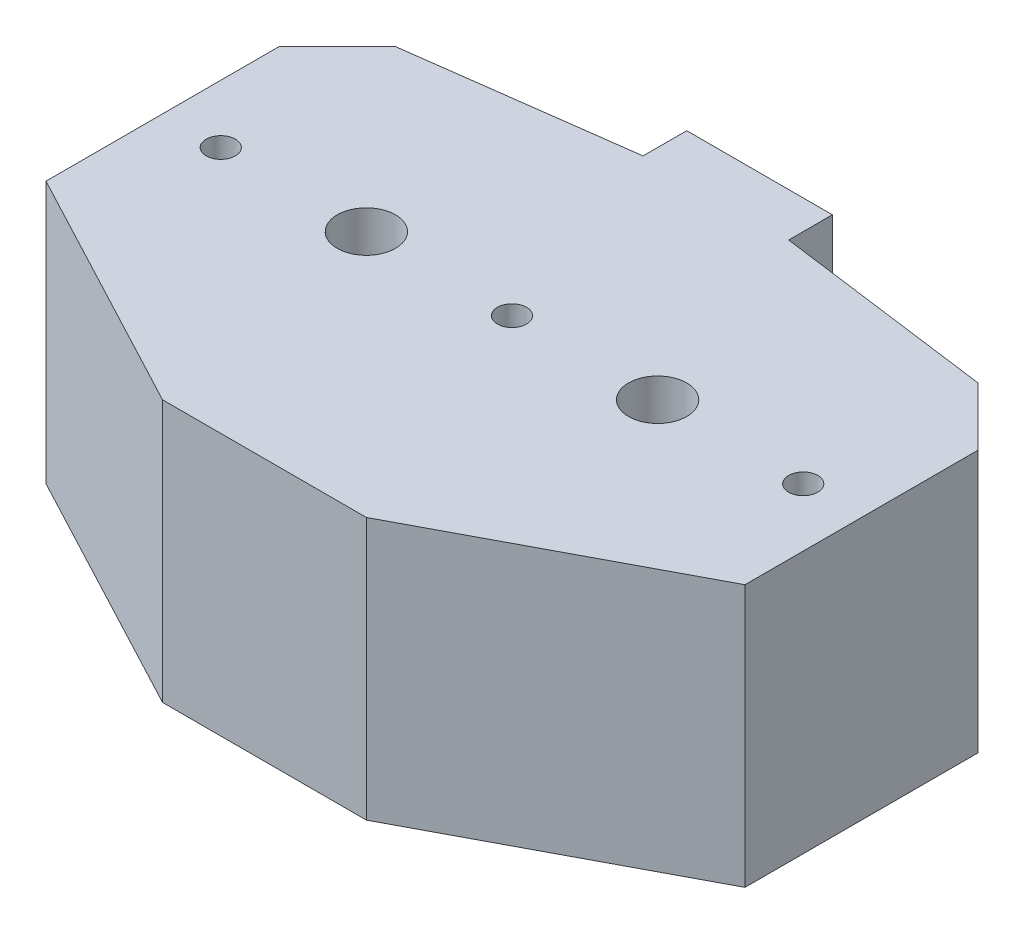
ISO-10303-21;
HEADER;
FILE_DESCRIPTION(('STEP AP214'),'2;1');
FILE_NAME('part.step','',(''),(''),'','','');
FILE_SCHEMA(('AUTOMOTIVE_DESIGN { 1 0 10303 214 1 1 1 1 }'));
ENDSEC;
DATA;
#1=APPLICATION_CONTEXT('core data for automotive mechanical design processes');
#2=APPLICATION_PROTOCOL_DEFINITION('international standard','automotive_design',2000,#1);
#3=PRODUCT_CONTEXT('',#1,'mechanical');
#4=PRODUCT('Part','Part','',(#3));
#5=PRODUCT_RELATED_PRODUCT_CATEGORY('part','',(#4));
#6=PRODUCT_DEFINITION_FORMATION('','',#4);
#7=PRODUCT_DEFINITION_CONTEXT('part definition',#1,'design');
#8=PRODUCT_DEFINITION('design','',#6,#7);
#9=PRODUCT_DEFINITION_SHAPE('','',#8);
#10=(LENGTH_UNIT() NAMED_UNIT(*) SI_UNIT(.MILLI.,.METRE.));
#11=(NAMED_UNIT(*) PLANE_ANGLE_UNIT() SI_UNIT($,.RADIAN.));
#12=(NAMED_UNIT(*) SI_UNIT($,.STERADIAN.) SOLID_ANGLE_UNIT());
#13=UNCERTAINTY_MEASURE_WITH_UNIT(LENGTH_MEASURE(1.E-05),#10,'distance_accuracy_value','');
#14=(GEOMETRIC_REPRESENTATION_CONTEXT(3) GLOBAL_UNCERTAINTY_ASSIGNED_CONTEXT((#13)) GLOBAL_UNIT_ASSIGNED_CONTEXT((#10,
#11,#12)) REPRESENTATION_CONTEXT('',''));
#15=CARTESIAN_POINT('',(0.,0.,0.));
#16=DIRECTION('',(0.,0.,1.));
#17=DIRECTION('',(1.,0.,0.));
#18=AXIS2_PLACEMENT_3D('',#15,#16,#17);
#19=CARTESIAN_POINT('',(0.,18.,0.));
#20=DIRECTION('',(0.,-1.,0.));
#21=DIRECTION('',(0.,0.,-1.));
#22=AXIS2_PLACEMENT_3D('',#19,#20,#21);
#23=PLANE('',#22);
#24=DIRECTION('',(-0.991227900682635,0.,0.132163720091018));
#25=VECTOR('',#24,1.);
#26=CARTESIAN_POINT('',(-20.,18.,-12.));
#27=LINE('',#26,#25);
#28=CARTESIAN_POINT('',(-5.,18.,-14.));
#29=VERTEX_POINT('',#28);
#30=CARTESIAN_POINT('',(-20.,18.,-12.));
#31=VERTEX_POINT('',#30);
#32=EDGE_CURVE('E178',#29,#31,#27,.T.);
#33=ORIENTED_EDGE('',*,*,#32,.T.);
#34=DIRECTION('',(-0.707106781186548,0.,0.707106781186548));
#35=VECTOR('',#34,1.);
#36=CARTESIAN_POINT('',(-24.,18.,-8.));
#37=LINE('',#36,#35);
#38=CARTESIAN_POINT('',(-24.,18.,-8.));
#39=VERTEX_POINT('',#38);
#40=EDGE_CURVE('E106',#31,#39,#37,.T.);
#41=ORIENTED_EDGE('',*,*,#40,.T.);
#42=DIRECTION('',(0.,0.,1.));
#43=VECTOR('',#42,1.);
#44=CARTESIAN_POINT('',(-24.,18.,8.));
#45=LINE('',#44,#43);
#46=CARTESIAN_POINT('',(-24.,18.,8.));
#47=VERTEX_POINT('',#46);
#48=EDGE_CURVE('E205',#39,#47,#45,.T.);
#49=ORIENTED_EDGE('',*,*,#48,.T.);
#50=DIRECTION('',(0.883787916347062,0.,0.467887720419033));
#51=VECTOR('',#50,1.);
#52=CARTESIAN_POINT('',(-7.,18.,17.));
#53=LINE('',#52,#51);
#54=CARTESIAN_POINT('',(-7.,18.,17.));
#55=VERTEX_POINT('',#54);
#56=EDGE_CURVE('E224',#47,#55,#53,.T.);
#57=ORIENTED_EDGE('',*,*,#56,.T.);
#58=DIRECTION('',(1.,0.,0.));
#59=VECTOR('',#58,1.);
#60=CARTESIAN_POINT('',(7.,18.,17.));
#61=LINE('',#60,#59);
#62=CARTESIAN_POINT('',(7.,18.,17.));
#63=VERTEX_POINT('',#62);
#64=EDGE_CURVE('E221',#55,#63,#61,.T.);
#65=ORIENTED_EDGE('',*,*,#64,.T.);
#66=DIRECTION('',(0.883787916347062,0.,-0.467887720419033));
#67=VECTOR('',#66,1.);
#68=CARTESIAN_POINT('',(24.,18.,8.));
#69=LINE('',#68,#67);
#70=CARTESIAN_POINT('',(24.,18.,8.));
#71=VERTEX_POINT('',#70);
#72=EDGE_CURVE('E223',#63,#71,#69,.T.);
#73=ORIENTED_EDGE('',*,*,#72,.T.);
#74=DIRECTION('',(0.,0.,-1.));
#75=VECTOR('',#74,1.);
#76=CARTESIAN_POINT('',(24.,18.,-8.));
#77=LINE('',#76,#75);
#78=CARTESIAN_POINT('',(24.,18.,-8.));
#79=VERTEX_POINT('',#78);
#80=EDGE_CURVE('E226',#71,#79,#77,.T.);
#81=ORIENTED_EDGE('',*,*,#80,.T.);
#82=DIRECTION('',(-0.707106781186548,0.,-0.707106781186548));
#83=VECTOR('',#82,1.);
#84=CARTESIAN_POINT('',(20.,18.,-12.));
#85=LINE('',#84,#83);
#86=CARTESIAN_POINT('',(20.,18.,-12.));
#87=VERTEX_POINT('',#86);
#88=EDGE_CURVE('E232',#79,#87,#85,.T.);
#89=ORIENTED_EDGE('',*,*,#88,.T.);
#90=DIRECTION('',(-0.991227900682635,0.,-0.132163720091018));
#91=VECTOR('',#90,1.);
#92=CARTESIAN_POINT('',(5.,18.,-14.));
#93=LINE('',#92,#91);
#94=CARTESIAN_POINT('',(5.,18.,-14.));
#95=VERTEX_POINT('',#94);
#96=EDGE_CURVE('E137',#87,#95,#93,.T.);
#97=ORIENTED_EDGE('',*,*,#96,.T.);
#98=DIRECTION('',(0.,0.,-1.));
#99=VECTOR('',#98,1.);
#100=CARTESIAN_POINT('',(5.,18.,-17.));
#101=LINE('',#100,#99);
#102=CARTESIAN_POINT('',(5.,18.,-17.));
#103=VERTEX_POINT('',#102);
#104=EDGE_CURVE('E131',#95,#103,#101,.T.);
#105=ORIENTED_EDGE('',*,*,#104,.T.);
#106=DIRECTION('',(-1.,0.,0.));
#107=VECTOR('',#106,1.);
#108=CARTESIAN_POINT('',(-5.,18.,-17.));
#109=LINE('',#108,#107);
#110=CARTESIAN_POINT('',(-5.,18.,-17.));
#111=VERTEX_POINT('',#110);
#112=EDGE_CURVE('E135',#103,#111,#109,.T.);
#113=ORIENTED_EDGE('',*,*,#112,.T.);
#114=DIRECTION('',(0.,0.,1.));
#115=VECTOR('',#114,1.);
#116=CARTESIAN_POINT('',(-5.,18.,-17.));
#117=LINE('',#116,#115);
#118=EDGE_CURVE('E51',#111,#29,#117,.T.);
#119=ORIENTED_EDGE('',*,*,#118,.T.);
#120=EDGE_LOOP('',(#33,#41,#49,#57,#65,#73,#81,#89,#97,#105,#113,#119));
#121=FACE_BOUND('',#120,.T.);
#122=CARTESIAN_POINT('',(20.,18.,0.));
#123=DIRECTION('',(0.,1.,0.));
#124=DIRECTION('',(0.,0.,1.));
#125=AXIS2_PLACEMENT_3D('',#122,#123,#124);
#126=CIRCLE('',#125,1.);
#127=CARTESIAN_POINT('',(20.,18.,1.));
#128=VERTEX_POINT('',#127);
#129=EDGE_CURVE('E159',#128,#128,#126,.T.);
#130=ORIENTED_EDGE('',*,*,#129,.F.);
#131=EDGE_LOOP('',(#130));
#132=FACE_BOUND('',#131,.T.);
#133=CARTESIAN_POINT('',(-20.,18.,1.39659253553725E-13));
#134=DIRECTION('',(0.,1.,0.));
#135=DIRECTION('',(0.,0.,1.));
#136=AXIS2_PLACEMENT_3D('',#133,#134,#135);
#137=CIRCLE('',#136,1.);
#138=CARTESIAN_POINT('',(-20.,18.,1.00000000000014));
#139=VERTEX_POINT('',#138);
#140=EDGE_CURVE('E306',#139,#139,#137,.T.);
#141=ORIENTED_EDGE('',*,*,#140,.F.);
#142=EDGE_LOOP('',(#141));
#143=FACE_BOUND('',#142,.T.);
#144=CARTESIAN_POINT('',(-10.,18.,0.));
#145=DIRECTION('',(0.,1.,0.));
#146=DIRECTION('',(0.,0.,1.));
#147=AXIS2_PLACEMENT_3D('',#144,#145,#146);
#148=CIRCLE('',#147,2.);
#149=CARTESIAN_POINT('',(-10.,18.,2.));
#150=VERTEX_POINT('',#149);
#151=EDGE_CURVE('E300',#150,#150,#148,.T.);
#152=ORIENTED_EDGE('',*,*,#151,.F.);
#153=EDGE_LOOP('',(#152));
#154=FACE_BOUND('',#153,.T.);
#155=CARTESIAN_POINT('',(0.,18.,0.));
#156=DIRECTION('',(0.,1.,0.));
#157=DIRECTION('',(0.,0.,1.));
#158=AXIS2_PLACEMENT_3D('',#155,#156,#157);
#159=CIRCLE('',#158,1.);
#160=CARTESIAN_POINT('',(0.,18.,1.));
#161=VERTEX_POINT('',#160);
#162=EDGE_CURVE('E294',#161,#161,#159,.T.);
#163=ORIENTED_EDGE('',*,*,#162,.F.);
#164=EDGE_LOOP('',(#163));
#165=FACE_BOUND('',#164,.T.);
#166=CARTESIAN_POINT('',(10.,18.,0.));
#167=DIRECTION('',(0.,1.,0.));
#168=DIRECTION('',(0.,0.,1.));
#169=AXIS2_PLACEMENT_3D('',#166,#167,#168);
#170=CIRCLE('',#169,2.);
#171=CARTESIAN_POINT('',(10.,18.,2.));
#172=VERTEX_POINT('',#171);
#173=EDGE_CURVE('E285',#172,#172,#170,.T.);
#174=ORIENTED_EDGE('',*,*,#173,.F.);
#175=EDGE_LOOP('',(#174));
#176=FACE_BOUND('',#175,.T.);
#177=ADVANCED_FACE('F34',(#121,#132,#143,#154,#165,#176),#23,.F.);
#178=CARTESIAN_POINT('',(0.,0.,0.));
#179=DIRECTION('',(0.,-1.,0.));
#180=DIRECTION('',(0.,0.,-1.));
#181=AXIS2_PLACEMENT_3D('',#178,#179,#180);
#182=PLANE('',#181);
#183=CARTESIAN_POINT('',(0.,0.,0.));
#184=DIRECTION('',(0.,1.,0.));
#185=DIRECTION('',(0.,0.,1.));
#186=AXIS2_PLACEMENT_3D('',#183,#184,#185);
#187=CIRCLE('',#186,1.);
#188=CARTESIAN_POINT('',(0.,0.,1.));
#189=VERTEX_POINT('',#188);
#190=EDGE_CURVE('E291',#189,#189,#187,.T.);
#191=ORIENTED_EDGE('',*,*,#190,.T.);
#192=EDGE_LOOP('',(#191));
#193=FACE_BOUND('',#192,.T.);
#194=CARTESIAN_POINT('',(-20.,0.,1.39659253553725E-13));
#195=DIRECTION('',(0.,1.,0.));
#196=DIRECTION('',(0.,0.,1.));
#197=AXIS2_PLACEMENT_3D('',#194,#195,#196);
#198=CIRCLE('',#197,1.);
#199=CARTESIAN_POINT('',(-20.,0.,1.00000000000014));
#200=VERTEX_POINT('',#199);
#201=EDGE_CURVE('E303',#200,#200,#198,.T.);
#202=ORIENTED_EDGE('',*,*,#201,.T.);
#203=EDGE_LOOP('',(#202));
#204=FACE_BOUND('',#203,.T.);
#205=DIRECTION('',(-0.991227900682635,0.,0.132163720091018));
#206=VECTOR('',#205,1.);
#207=CARTESIAN_POINT('',(-20.,0.,-12.));
#208=LINE('',#207,#206);
#209=CARTESIAN_POINT('',(-5.,0.,-14.));
#210=VERTEX_POINT('',#209);
#211=CARTESIAN_POINT('',(-20.,0.,-12.));
#212=VERTEX_POINT('',#211);
#213=EDGE_CURVE('E155',#210,#212,#208,.T.);
#214=ORIENTED_EDGE('',*,*,#213,.F.);
#215=DIRECTION('',(0.,0.,1.));
#216=VECTOR('',#215,1.);
#217=CARTESIAN_POINT('',(-5.,0.,-17.));
#218=LINE('',#217,#216);
#219=CARTESIAN_POINT('',(-5.,0.,-17.));
#220=VERTEX_POINT('',#219);
#221=EDGE_CURVE('E98',#220,#210,#218,.T.);
#222=ORIENTED_EDGE('',*,*,#221,.F.);
#223=DIRECTION('',(-1.,0.,0.));
#224=VECTOR('',#223,1.);
#225=CARTESIAN_POINT('',(-5.,0.,-17.));
#226=LINE('',#225,#224);
#227=CARTESIAN_POINT('',(5.,0.,-17.));
#228=VERTEX_POINT('',#227);
#229=EDGE_CURVE('E92',#228,#220,#226,.T.);
#230=ORIENTED_EDGE('',*,*,#229,.F.);
#231=DIRECTION('',(0.,0.,-1.));
#232=VECTOR('',#231,1.);
#233=CARTESIAN_POINT('',(5.,0.,-17.));
#234=LINE('',#233,#232);
#235=CARTESIAN_POINT('',(5.,0.,-14.));
#236=VERTEX_POINT('',#235);
#237=EDGE_CURVE('E145',#236,#228,#234,.T.);
#238=ORIENTED_EDGE('',*,*,#237,.F.);
#239=DIRECTION('',(-0.991227900682635,0.,-0.132163720091018));
#240=VECTOR('',#239,1.);
#241=CARTESIAN_POINT('',(5.,0.,-14.));
#242=LINE('',#241,#240);
#243=CARTESIAN_POINT('',(20.,0.,-12.));
#244=VERTEX_POINT('',#243);
#245=EDGE_CURVE('E173',#244,#236,#242,.T.);
#246=ORIENTED_EDGE('',*,*,#245,.F.);
#247=DIRECTION('',(-0.707106781186548,0.,-0.707106781186548));
#248=VECTOR('',#247,1.);
#249=CARTESIAN_POINT('',(20.,0.,-12.));
#250=LINE('',#249,#248);
#251=CARTESIAN_POINT('',(24.,0.,-8.));
#252=VERTEX_POINT('',#251);
#253=EDGE_CURVE('E171',#252,#244,#250,.T.);
#254=ORIENTED_EDGE('',*,*,#253,.F.);
#255=DIRECTION('',(0.,0.,-1.));
#256=VECTOR('',#255,1.);
#257=CARTESIAN_POINT('',(24.,0.,-8.));
#258=LINE('',#257,#256);
#259=CARTESIAN_POINT('',(24.,0.,8.));
#260=VERTEX_POINT('',#259);
#261=EDGE_CURVE('E169',#260,#252,#258,.T.);
#262=ORIENTED_EDGE('',*,*,#261,.F.);
#263=DIRECTION('',(0.883787916347062,0.,-0.467887720419033));
#264=VECTOR('',#263,1.);
#265=CARTESIAN_POINT('',(24.,0.,8.));
#266=LINE('',#265,#264);
#267=CARTESIAN_POINT('',(7.,0.,17.));
#268=VERTEX_POINT('',#267);
#269=EDGE_CURVE('E167',#268,#260,#266,.T.);
#270=ORIENTED_EDGE('',*,*,#269,.F.);
#271=DIRECTION('',(1.,0.,0.));
#272=VECTOR('',#271,1.);
#273=CARTESIAN_POINT('',(7.,0.,17.));
#274=LINE('',#273,#272);
#275=CARTESIAN_POINT('',(-7.,0.,17.));
#276=VERTEX_POINT('',#275);
#277=EDGE_CURVE('E165',#276,#268,#274,.T.);
#278=ORIENTED_EDGE('',*,*,#277,.F.);
#279=DIRECTION('',(0.883787916347062,0.,0.467887720419033));
#280=VECTOR('',#279,1.);
#281=CARTESIAN_POINT('',(-7.,0.,17.));
#282=LINE('',#281,#280);
#283=CARTESIAN_POINT('',(-24.,0.,8.));
#284=VERTEX_POINT('',#283);
#285=EDGE_CURVE('E163',#284,#276,#282,.T.);
#286=ORIENTED_EDGE('',*,*,#285,.F.);
#287=DIRECTION('',(0.,0.,1.));
#288=VECTOR('',#287,1.);
#289=CARTESIAN_POINT('',(-24.,0.,8.));
#290=LINE('',#289,#288);
#291=CARTESIAN_POINT('',(-24.,0.,-8.));
#292=VERTEX_POINT('',#291);
#293=EDGE_CURVE('E161',#292,#284,#290,.T.);
#294=ORIENTED_EDGE('',*,*,#293,.F.);
#295=DIRECTION('',(-0.707106781186548,0.,0.707106781186548));
#296=VECTOR('',#295,1.);
#297=CARTESIAN_POINT('',(-24.,0.,-8.));
#298=LINE('',#297,#296);
#299=EDGE_CURVE('E158',#212,#292,#298,.T.);
#300=ORIENTED_EDGE('',*,*,#299,.F.);
#301=EDGE_LOOP('',(#214,#222,#230,#238,#246,#254,#262,#270,#278,#286,#294,#300));
#302=FACE_BOUND('',#301,.T.);
#303=CARTESIAN_POINT('',(20.,0.,0.));
#304=DIRECTION('',(0.,1.,0.));
#305=DIRECTION('',(0.,0.,1.));
#306=AXIS2_PLACEMENT_3D('',#303,#304,#305);
#307=CIRCLE('',#306,1.);
#308=CARTESIAN_POINT('',(20.,0.,1.));
#309=VERTEX_POINT('',#308);
#310=EDGE_CURVE('E309',#309,#309,#307,.T.);
#311=ORIENTED_EDGE('',*,*,#310,.T.);
#312=EDGE_LOOP('',(#311));
#313=FACE_BOUND('',#312,.T.);
#314=CARTESIAN_POINT('',(-10.,0.,0.));
#315=DIRECTION('',(0.,1.,0.));
#316=DIRECTION('',(0.,0.,1.));
#317=AXIS2_PLACEMENT_3D('',#314,#315,#316);
#318=CIRCLE('',#317,2.);
#319=CARTESIAN_POINT('',(-10.,0.,2.));
#320=VERTEX_POINT('',#319);
#321=EDGE_CURVE('E297',#320,#320,#318,.T.);
#322=ORIENTED_EDGE('',*,*,#321,.T.);
#323=EDGE_LOOP('',(#322));
#324=FACE_BOUND('',#323,.T.);
#325=CARTESIAN_POINT('',(10.,0.,0.));
#326=DIRECTION('',(0.,1.,0.));
#327=DIRECTION('',(0.,0.,1.));
#328=AXIS2_PLACEMENT_3D('',#325,#326,#327);
#329=CIRCLE('',#328,2.);
#330=CARTESIAN_POINT('',(10.,0.,2.));
#331=VERTEX_POINT('',#330);
#332=EDGE_CURVE('E288',#331,#331,#329,.T.);
#333=ORIENTED_EDGE('',*,*,#332,.T.);
#334=EDGE_LOOP('',(#333));
#335=FACE_BOUND('',#334,.T.);
#336=ADVANCED_FACE('F209',(#193,#204,#302,#313,#324,#335),#182,.T.);
#337=CARTESIAN_POINT('',(-20.,18.,-12.));
#338=DIRECTION('',(0.132163720091018,0.,0.991227900682635));
#339=DIRECTION('',(0.991227900682635,0.,-0.132163720091018));
#340=AXIS2_PLACEMENT_3D('',#337,#338,#339);
#341=PLANE('',#340);
#342=ORIENTED_EDGE('',*,*,#213,.T.);
#343=DIRECTION('',(0.,-1.,0.));
#344=VECTOR('',#343,1.);
#345=CARTESIAN_POINT('',(-20.,18.,-12.));
#346=LINE('',#345,#344);
#347=EDGE_CURVE('E11',#31,#212,#346,.T.);
#348=ORIENTED_EDGE('',*,*,#347,.F.);
#349=ORIENTED_EDGE('',*,*,#32,.F.);
#350=DIRECTION('',(0.,-1.,0.));
#351=VECTOR('',#350,1.);
#352=CARTESIAN_POINT('',(-5.,18.,-14.));
#353=LINE('',#352,#351);
#354=EDGE_CURVE('E151',#29,#210,#353,.T.);
#355=ORIENTED_EDGE('',*,*,#354,.T.);
#356=EDGE_LOOP('',(#342,#348,#349,#355));
#357=FACE_BOUND('',#356,.T.);
#358=ADVANCED_FACE('F36',(#357),#341,.F.);
#359=CARTESIAN_POINT('',(-24.,18.,-8.));
#360=DIRECTION('',(0.707106781186547,0.,0.707106781186547));
#361=DIRECTION('',(0.707106781186548,0.,-0.707106781186548));
#362=AXIS2_PLACEMENT_3D('',#359,#360,#361);
#363=PLANE('',#362);
#364=ORIENTED_EDGE('',*,*,#299,.T.);
#365=DIRECTION('',(0.,-1.,0.));
#366=VECTOR('',#365,1.);
#367=CARTESIAN_POINT('',(-24.,18.,-8.));
#368=LINE('',#367,#366);
#369=EDGE_CURVE('E43',#39,#292,#368,.T.);
#370=ORIENTED_EDGE('',*,*,#369,.F.);
#371=ORIENTED_EDGE('',*,*,#40,.F.);
#372=ORIENTED_EDGE('',*,*,#347,.T.);
#373=EDGE_LOOP('',(#364,#370,#371,#372));
#374=FACE_BOUND('',#373,.T.);
#375=ADVANCED_FACE('F430',(#374),#363,.F.);
#376=CARTESIAN_POINT('',(-24.,18.,8.));
#377=DIRECTION('',(1.,0.,0.));
#378=DIRECTION('',(0.,0.,-1.));
#379=AXIS2_PLACEMENT_3D('',#376,#377,#378);
#380=PLANE('',#379);
#381=ORIENTED_EDGE('',*,*,#293,.T.);
#382=DIRECTION('',(0.,-1.,0.));
#383=VECTOR('',#382,1.);
#384=CARTESIAN_POINT('',(-24.,18.,8.));
#385=LINE('',#384,#383);
#386=EDGE_CURVE('E197',#47,#284,#385,.T.);
#387=ORIENTED_EDGE('',*,*,#386,.F.);
#388=ORIENTED_EDGE('',*,*,#48,.F.);
#389=ORIENTED_EDGE('',*,*,#369,.T.);
#390=EDGE_LOOP('',(#381,#387,#388,#389));
#391=FACE_BOUND('',#390,.T.);
#392=ADVANCED_FACE('F203',(#391),#380,.F.);
#393=CARTESIAN_POINT('',(-7.,18.,17.));
#394=DIRECTION('',(0.467887720419033,0.,-0.883787916347062));
#395=DIRECTION('',(-0.883787916347062,0.,-0.467887720419033));
#396=AXIS2_PLACEMENT_3D('',#393,#394,#395);
#397=PLANE('',#396);
#398=ORIENTED_EDGE('',*,*,#285,.T.);
#399=DIRECTION('',(0.,-1.,0.));
#400=VECTOR('',#399,1.);
#401=CARTESIAN_POINT('',(-7.,18.,17.));
#402=LINE('',#401,#400);
#403=EDGE_CURVE('E194',#55,#276,#402,.T.);
#404=ORIENTED_EDGE('',*,*,#403,.F.);
#405=ORIENTED_EDGE('',*,*,#56,.F.);
#406=ORIENTED_EDGE('',*,*,#386,.T.);
#407=EDGE_LOOP('',(#398,#404,#405,#406));
#408=FACE_BOUND('',#407,.T.);
#409=ADVANCED_FACE('F215',(#408),#397,.F.);
#410=CARTESIAN_POINT('',(7.,18.,17.));
#411=DIRECTION('',(0.,0.,-1.));
#412=DIRECTION('',(-1.,0.,0.));
#413=AXIS2_PLACEMENT_3D('',#410,#411,#412);
#414=PLANE('',#413);
#415=ORIENTED_EDGE('',*,*,#277,.T.);
#416=DIRECTION('',(0.,-1.,0.));
#417=VECTOR('',#416,1.);
#418=CARTESIAN_POINT('',(7.,18.,17.));
#419=LINE('',#418,#417);
#420=EDGE_CURVE('E191',#63,#268,#419,.T.);
#421=ORIENTED_EDGE('',*,*,#420,.F.);
#422=ORIENTED_EDGE('',*,*,#64,.F.);
#423=ORIENTED_EDGE('',*,*,#403,.T.);
#424=EDGE_LOOP('',(#415,#421,#422,#423));
#425=FACE_BOUND('',#424,.T.);
#426=ADVANCED_FACE('F219',(#425),#414,.F.);
#427=CARTESIAN_POINT('',(24.,18.,8.));
#428=DIRECTION('',(-0.467887720419033,0.,-0.883787916347062));
#429=DIRECTION('',(-0.883787916347062,0.,0.467887720419033));
#430=AXIS2_PLACEMENT_3D('',#427,#428,#429);
#431=PLANE('',#430);
#432=ORIENTED_EDGE('',*,*,#269,.T.);
#433=DIRECTION('',(0.,-1.,0.));
#434=VECTOR('',#433,1.);
#435=CARTESIAN_POINT('',(24.,18.,8.));
#436=LINE('',#435,#434);
#437=EDGE_CURVE('E188',#71,#260,#436,.T.);
#438=ORIENTED_EDGE('',*,*,#437,.F.);
#439=ORIENTED_EDGE('',*,*,#72,.F.);
#440=ORIENTED_EDGE('',*,*,#420,.T.);
#441=EDGE_LOOP('',(#432,#438,#439,#440));
#442=FACE_BOUND('',#441,.T.);
#443=ADVANCED_FACE('F395',(#442),#431,.F.);
#444=CARTESIAN_POINT('',(24.,18.,-8.));
#445=DIRECTION('',(-1.,0.,0.));
#446=DIRECTION('',(0.,0.,1.));
#447=AXIS2_PLACEMENT_3D('',#444,#445,#446);
#448=PLANE('',#447);
#449=ORIENTED_EDGE('',*,*,#261,.T.);
#450=DIRECTION('',(0.,-1.,0.));
#451=VECTOR('',#450,1.);
#452=CARTESIAN_POINT('',(24.,18.,-8.));
#453=LINE('',#452,#451);
#454=EDGE_CURVE('E185',#79,#252,#453,.T.);
#455=ORIENTED_EDGE('',*,*,#454,.F.);
#456=ORIENTED_EDGE('',*,*,#80,.F.);
#457=ORIENTED_EDGE('',*,*,#437,.T.);
#458=EDGE_LOOP('',(#449,#455,#456,#457));
#459=FACE_BOUND('',#458,.T.);
#460=ADVANCED_FACE('F386',(#459),#448,.F.);
#461=CARTESIAN_POINT('',(20.,18.,-12.));
#462=DIRECTION('',(-0.707106781186547,0.,0.707106781186547));
#463=DIRECTION('',(0.707106781186548,0.,0.707106781186548));
#464=AXIS2_PLACEMENT_3D('',#461,#462,#463);
#465=PLANE('',#464);
#466=ORIENTED_EDGE('',*,*,#253,.T.);
#467=DIRECTION('',(0.,-1.,0.));
#468=VECTOR('',#467,1.);
#469=CARTESIAN_POINT('',(20.,18.,-12.));
#470=LINE('',#469,#468);
#471=EDGE_CURVE('E182',#87,#244,#470,.T.);
#472=ORIENTED_EDGE('',*,*,#471,.F.);
#473=ORIENTED_EDGE('',*,*,#88,.F.);
#474=ORIENTED_EDGE('',*,*,#454,.T.);
#475=EDGE_LOOP('',(#466,#472,#473,#474));
#476=FACE_BOUND('',#475,.T.);
#477=ADVANCED_FACE('F238',(#476),#465,.F.);
#478=CARTESIAN_POINT('',(5.,18.,-14.));
#479=DIRECTION('',(-0.132163720091018,0.,0.991227900682635));
#480=DIRECTION('',(0.991227900682635,0.,0.132163720091018));
#481=AXIS2_PLACEMENT_3D('',#478,#479,#480);
#482=PLANE('',#481);
#483=ORIENTED_EDGE('',*,*,#245,.T.);
#484=DIRECTION('',(0.,-1.,0.));
#485=VECTOR('',#484,1.);
#486=CARTESIAN_POINT('',(5.,18.,-14.));
#487=LINE('',#486,#485);
#488=EDGE_CURVE('E146',#95,#236,#487,.T.);
#489=ORIENTED_EDGE('',*,*,#488,.F.);
#490=ORIENTED_EDGE('',*,*,#96,.F.);
#491=ORIENTED_EDGE('',*,*,#471,.T.);
#492=EDGE_LOOP('',(#483,#489,#490,#491));
#493=FACE_BOUND('',#492,.T.);
#494=ADVANCED_FACE('F242',(#493),#482,.F.);
#495=CARTESIAN_POINT('',(5.,18.,-17.));
#496=DIRECTION('',(-1.,0.,0.));
#497=DIRECTION('',(0.,0.,1.));
#498=AXIS2_PLACEMENT_3D('',#495,#496,#497);
#499=PLANE('',#498);
#500=ORIENTED_EDGE('',*,*,#237,.T.);
#501=DIRECTION('',(0.,-1.,0.));
#502=VECTOR('',#501,1.);
#503=CARTESIAN_POINT('',(5.,18.,-17.));
#504=LINE('',#503,#502);
#505=EDGE_CURVE('E142',#103,#228,#504,.T.);
#506=ORIENTED_EDGE('',*,*,#505,.F.);
#507=ORIENTED_EDGE('',*,*,#104,.F.);
#508=ORIENTED_EDGE('',*,*,#488,.T.);
#509=EDGE_LOOP('',(#500,#506,#507,#508));
#510=FACE_BOUND('',#509,.T.);
#511=ADVANCED_FACE('F143',(#510),#499,.F.);
#512=CARTESIAN_POINT('',(-5.,18.,-17.));
#513=DIRECTION('',(0.,0.,1.));
#514=DIRECTION('',(1.,0.,0.));
#515=AXIS2_PLACEMENT_3D('',#512,#513,#514);
#516=PLANE('',#515);
#517=ORIENTED_EDGE('',*,*,#229,.T.);
#518=DIRECTION('',(0.,-1.,0.));
#519=VECTOR('',#518,1.);
#520=CARTESIAN_POINT('',(-5.,18.,-17.));
#521=LINE('',#520,#519);
#522=EDGE_CURVE('E147',#111,#220,#521,.T.);
#523=ORIENTED_EDGE('',*,*,#522,.F.);
#524=ORIENTED_EDGE('',*,*,#112,.F.);
#525=ORIENTED_EDGE('',*,*,#505,.T.);
#526=EDGE_LOOP('',(#517,#523,#524,#525));
#527=FACE_BOUND('',#526,.T.);
#528=ADVANCED_FACE('F149',(#527),#516,.F.);
#529=CARTESIAN_POINT('',(-5.,18.,-17.));
#530=DIRECTION('',(1.,0.,0.));
#531=DIRECTION('',(0.,0.,-1.));
#532=AXIS2_PLACEMENT_3D('',#529,#530,#531);
#533=PLANE('',#532);
#534=ORIENTED_EDGE('',*,*,#221,.T.);
#535=ORIENTED_EDGE('',*,*,#354,.F.);
#536=ORIENTED_EDGE('',*,*,#118,.F.);
#537=ORIENTED_EDGE('',*,*,#522,.T.);
#538=EDGE_LOOP('',(#534,#535,#536,#537));
#539=FACE_BOUND('',#538,.T.);
#540=ADVANCED_FACE('F246',(#539),#533,.F.);
#541=CARTESIAN_POINT('',(20.,18.,0.));
#542=DIRECTION('',(0.,-1.,0.));
#543=DIRECTION('',(0.,0.,-1.));
#544=AXIS2_PLACEMENT_3D('',#541,#542,#543);
#545=CYLINDRICAL_SURFACE('',#544,1.);
#546=ORIENTED_EDGE('',*,*,#129,.T.);
#547=EDGE_LOOP('',(#546));
#548=FACE_BOUND('',#547,.T.);
#549=ORIENTED_EDGE('',*,*,#310,.F.);
#550=EDGE_LOOP('',(#549));
#551=FACE_BOUND('',#550,.T.);
#552=ADVANCED_FACE('F248',(#548,#551),#545,.F.);
#553=CARTESIAN_POINT('',(-20.,18.,1.39659253553725E-13));
#554=DIRECTION('',(0.,-1.,0.));
#555=DIRECTION('',(0.,0.,-1.));
#556=AXIS2_PLACEMENT_3D('',#553,#554,#555);
#557=CYLINDRICAL_SURFACE('',#556,1.);
#558=ORIENTED_EDGE('',*,*,#140,.T.);
#559=EDGE_LOOP('',(#558));
#560=FACE_BOUND('',#559,.T.);
#561=ORIENTED_EDGE('',*,*,#201,.F.);
#562=EDGE_LOOP('',(#561));
#563=FACE_BOUND('',#562,.T.);
#564=ADVANCED_FACE('F254',(#560,#563),#557,.F.);
#565=CARTESIAN_POINT('',(-10.,18.,0.));
#566=DIRECTION('',(0.,-1.,0.));
#567=DIRECTION('',(0.,0.,-1.));
#568=AXIS2_PLACEMENT_3D('',#565,#566,#567);
#569=CYLINDRICAL_SURFACE('',#568,2.);
#570=ORIENTED_EDGE('',*,*,#151,.T.);
#571=EDGE_LOOP('',(#570));
#572=FACE_BOUND('',#571,.T.);
#573=ORIENTED_EDGE('',*,*,#321,.F.);
#574=EDGE_LOOP('',(#573));
#575=FACE_BOUND('',#574,.T.);
#576=ADVANCED_FACE('F268',(#572,#575),#569,.F.);
#577=CARTESIAN_POINT('',(0.,18.,0.));
#578=DIRECTION('',(0.,-1.,0.));
#579=DIRECTION('',(0.,0.,-1.));
#580=AXIS2_PLACEMENT_3D('',#577,#578,#579);
#581=CYLINDRICAL_SURFACE('',#580,1.);
#582=ORIENTED_EDGE('',*,*,#162,.T.);
#583=EDGE_LOOP('',(#582));
#584=FACE_BOUND('',#583,.T.);
#585=ORIENTED_EDGE('',*,*,#190,.F.);
#586=EDGE_LOOP('',(#585));
#587=FACE_BOUND('',#586,.T.);
#588=ADVANCED_FACE('F272',(#584,#587),#581,.F.);
#589=CARTESIAN_POINT('',(10.,18.,0.));
#590=DIRECTION('',(0.,-1.,0.));
#591=DIRECTION('',(0.,0.,-1.));
#592=AXIS2_PLACEMENT_3D('',#589,#590,#591);
#593=CYLINDRICAL_SURFACE('',#592,2.);
#594=ORIENTED_EDGE('',*,*,#173,.T.);
#595=EDGE_LOOP('',(#594));
#596=FACE_BOUND('',#595,.T.);
#597=ORIENTED_EDGE('',*,*,#332,.F.);
#598=EDGE_LOOP('',(#597));
#599=FACE_BOUND('',#598,.T.);
#600=ADVANCED_FACE('F276',(#596,#599),#593,.F.);
#601=CLOSED_SHELL('',(#177,#336,#358,#375,#392,#409,#426,#443,#460,#477,#494,#511,#528,#540,
#552,#564,#576,#588,#600));
#602=MANIFOLD_SOLID_BREP('B2',#601);
#603=ADVANCED_BREP_SHAPE_REPRESENTATION('',(#18,#602),#14);
#604=SHAPE_DEFINITION_REPRESENTATION(#9,#603);
ENDSEC;
END-ISO-10303-21;
